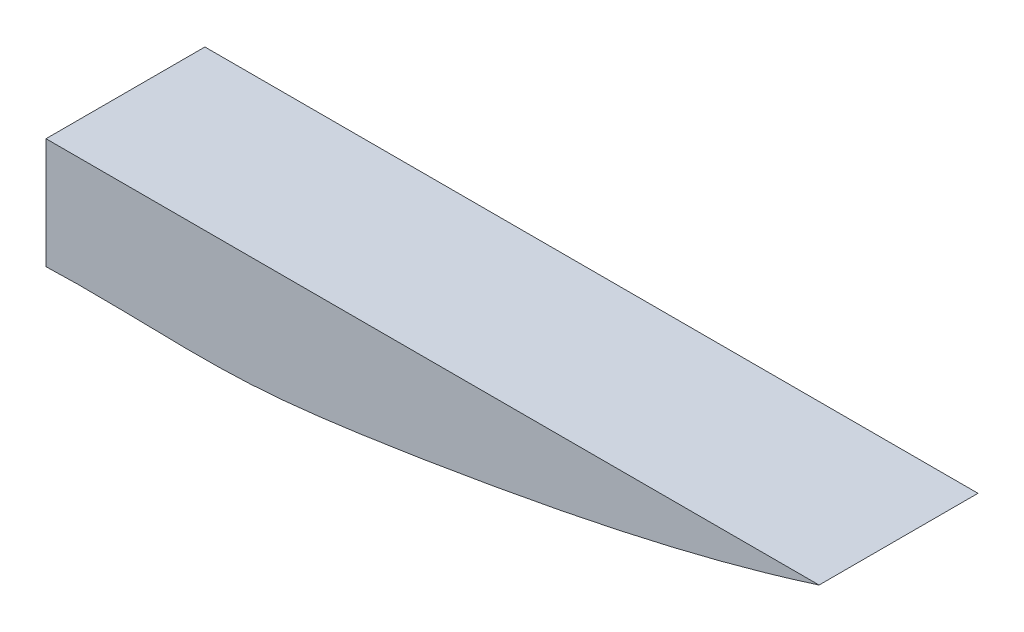
ISO-10303-21;
HEADER;
FILE_DESCRIPTION(('STEP AP214'),'2;1');
FILE_NAME('part.step','',(''),(''),'','','');
FILE_SCHEMA(('AUTOMOTIVE_DESIGN { 1 0 10303 214 1 1 1 1 }'));
ENDSEC;
DATA;
#1=APPLICATION_CONTEXT('core data for automotive mechanical design processes');
#2=APPLICATION_PROTOCOL_DEFINITION('international standard','automotive_design',2000,#1);
#3=PRODUCT_CONTEXT('',#1,'mechanical');
#4=PRODUCT('Part','Part','',(#3));
#5=PRODUCT_RELATED_PRODUCT_CATEGORY('part','',(#4));
#6=PRODUCT_DEFINITION_FORMATION('','',#4);
#7=PRODUCT_DEFINITION_CONTEXT('part definition',#1,'design');
#8=PRODUCT_DEFINITION('design','',#6,#7);
#9=PRODUCT_DEFINITION_SHAPE('','',#8);
#10=(LENGTH_UNIT() NAMED_UNIT(*) SI_UNIT(.MILLI.,.METRE.));
#11=(NAMED_UNIT(*) PLANE_ANGLE_UNIT() SI_UNIT($,.RADIAN.));
#12=(NAMED_UNIT(*) SI_UNIT($,.STERADIAN.) SOLID_ANGLE_UNIT());
#13=UNCERTAINTY_MEASURE_WITH_UNIT(LENGTH_MEASURE(1.E-05),#10,'distance_accuracy_value','');
#14=(GEOMETRIC_REPRESENTATION_CONTEXT(3) GLOBAL_UNCERTAINTY_ASSIGNED_CONTEXT((#13)) GLOBAL_UNIT_ASSIGNED_CONTEXT((#10,
#11,#12)) REPRESENTATION_CONTEXT('',''));
#15=CARTESIAN_POINT('',(0.,0.,0.));
#16=DIRECTION('',(0.,0.,1.));
#17=DIRECTION('',(1.,0.,0.));
#18=AXIS2_PLACEMENT_3D('',#15,#16,#17);
#19=CARTESIAN_POINT('',(0.,0.,-21.5));
#20=DIRECTION('',(0.,1.,0.));
#21=DIRECTION('',(0.,0.,1.));
#22=AXIS2_PLACEMENT_3D('',#19,#20,#21);
#23=PLANE('',#22);
#24=DIRECTION('',(-1.,0.,0.));
#25=VECTOR('',#24,1.);
#26=CARTESIAN_POINT('',(0.,0.,0.));
#27=LINE('',#26,#25);
#28=CARTESIAN_POINT('',(104.6,0.,0.));
#29=VERTEX_POINT('',#28);
#30=CARTESIAN_POINT('',(0.,0.,0.));
#31=VERTEX_POINT('',#30);
#32=EDGE_CURVE('E90',#29,#31,#27,.T.);
#33=ORIENTED_EDGE('',*,*,#32,.F.);
#34=DIRECTION('',(0.,0.,1.));
#35=VECTOR('',#34,1.);
#36=CARTESIAN_POINT('',(104.6,0.,-21.5));
#37=LINE('',#36,#35);
#38=CARTESIAN_POINT('',(104.6,0.,-21.5));
#39=VERTEX_POINT('',#38);
#40=EDGE_CURVE('E11',#39,#29,#37,.T.);
#41=ORIENTED_EDGE('',*,*,#40,.F.);
#42=DIRECTION('',(-1.,0.,0.));
#43=VECTOR('',#42,1.);
#44=CARTESIAN_POINT('',(0.,0.,-21.5));
#45=LINE('',#44,#43);
#46=CARTESIAN_POINT('',(0.,0.,-21.5));
#47=VERTEX_POINT('',#46);
#48=EDGE_CURVE('E79',#39,#47,#45,.T.);
#49=ORIENTED_EDGE('',*,*,#48,.T.);
#50=DIRECTION('',(0.,0.,1.));
#51=VECTOR('',#50,1.);
#52=CARTESIAN_POINT('',(0.,0.,-21.5));
#53=LINE('',#52,#51);
#54=EDGE_CURVE('E38',#47,#31,#53,.T.);
#55=ORIENTED_EDGE('',*,*,#54,.T.);
#56=EDGE_LOOP('',(#33,#41,#49,#55));
#57=FACE_BOUND('',#56,.T.);
#58=ADVANCED_FACE('F35',(#57),#23,.T.);
#59=CARTESIAN_POINT('',(0.,-15.,-21.5));
#60=CARTESIAN_POINT('',(8.72209860037072,-14.6533761054762,-21.5));
#61=CARTESIAN_POINT('',(23.1679338693288,-15.8337992283628,-21.5));
#62=CARTESIAN_POINT('',(42.3954806364705,-13.4598614785974,-21.5));
#63=CARTESIAN_POINT('',(68.6905575955601,-9.2077903351784,-21.5));
#64=CARTESIAN_POINT('',(89.2679365314157,-4.90292383187878,-21.5));
#65=CARTESIAN_POINT('',(104.6,0.,-21.5));
#66=B_SPLINE_CURVE_WITH_KNOTS('',3,(#59,#60,#61,#62,#63,#64,#65),.UNSPECIFIED.,.F.,.F.,(4,1,1,1,
4),(0.,0.246872266456216,0.406938063457193,0.546001010684599,1.),.UNSPECIFIED.);
#67=DIRECTION('',(0.,0.,1.));
#68=VECTOR('',#67,1.);
#69=SURFACE_OF_LINEAR_EXTRUSION('',#66,#68);
#70=CARTESIAN_POINT('',(0.,-15.,0.));
#71=CARTESIAN_POINT('',(8.72209860037072,-14.6533761054762,0.));
#72=CARTESIAN_POINT('',(23.1679338693288,-15.8337992283628,0.));
#73=CARTESIAN_POINT('',(42.3954806364705,-13.4598614785974,0.));
#74=CARTESIAN_POINT('',(68.6905575955601,-9.2077903351784,0.));
#75=CARTESIAN_POINT('',(89.2679365314157,-4.90292383187878,0.));
#76=CARTESIAN_POINT('',(104.6,0.,0.));
#77=B_SPLINE_CURVE_WITH_KNOTS('',3,(#70,#71,#72,#73,#74,#75,#76),.UNSPECIFIED.,.F.,.F.,(4,1,1,1,
4),(0.,0.246872266456216,0.406938063457193,0.546001010684599,1.),.UNSPECIFIED.);
#78=CARTESIAN_POINT('',(0.,-15.,0.));
#79=VERTEX_POINT('',#78);
#80=EDGE_CURVE('E81',#79,#29,#77,.T.);
#81=ORIENTED_EDGE('',*,*,#80,.F.);
#82=DIRECTION('',(0.,0.,1.));
#83=VECTOR('',#82,1.);
#84=CARTESIAN_POINT('',(0.,-15.,-21.5));
#85=LINE('',#84,#83);
#86=CARTESIAN_POINT('',(0.,-15.,-21.5));
#87=VERTEX_POINT('',#86);
#88=EDGE_CURVE('E44',#87,#79,#85,.T.);
#89=ORIENTED_EDGE('',*,*,#88,.F.);
#90=EDGE_CURVE('E76',#87,#39,#66,.T.);
#91=ORIENTED_EDGE('',*,*,#90,.T.);
#92=ORIENTED_EDGE('',*,*,#40,.T.);
#93=EDGE_LOOP('',(#81,#89,#91,#92));
#94=FACE_BOUND('',#93,.T.);
#95=ADVANCED_FACE('F96',(#94),#69,.T.);
#96=CARTESIAN_POINT('',(0.,0.,-21.5));
#97=DIRECTION('',(-1.,0.,0.));
#98=DIRECTION('',(0.,-1.,0.));
#99=AXIS2_PLACEMENT_3D('',#96,#97,#98);
#100=PLANE('',#99);
#101=DIRECTION('',(0.,-1.,0.));
#102=VECTOR('',#101,1.);
#103=CARTESIAN_POINT('',(0.,0.,0.));
#104=LINE('',#103,#102);
#105=EDGE_CURVE('E74',#31,#79,#104,.T.);
#106=ORIENTED_EDGE('',*,*,#105,.F.);
#107=ORIENTED_EDGE('',*,*,#54,.F.);
#108=DIRECTION('',(0.,-1.,0.));
#109=VECTOR('',#108,1.);
#110=CARTESIAN_POINT('',(0.,0.,-21.5));
#111=LINE('',#110,#109);
#112=EDGE_CURVE('E72',#47,#87,#111,.T.);
#113=ORIENTED_EDGE('',*,*,#112,.T.);
#114=ORIENTED_EDGE('',*,*,#88,.T.);
#115=EDGE_LOOP('',(#106,#107,#113,#114));
#116=FACE_BOUND('',#115,.T.);
#117=ADVANCED_FACE('F71',(#116),#100,.T.);
#118=CARTESIAN_POINT('',(52.8735863508143,-11.7462325671097,-21.5));
#119=DIRECTION('',(0.,0.,1.));
#120=DIRECTION('',(1.,0.,0.));
#121=AXIS2_PLACEMENT_3D('',#118,#119,#120);
#122=PLANE('',#121);
#123=ORIENTED_EDGE('',*,*,#48,.F.);
#124=ORIENTED_EDGE('',*,*,#90,.F.);
#125=ORIENTED_EDGE('',*,*,#112,.F.);
#126=EDGE_LOOP('',(#123,#124,#125));
#127=FACE_BOUND('',#126,.T.);
#128=ADVANCED_FACE('F78',(#127),#122,.F.);
#129=CARTESIAN_POINT('',(52.8735863508143,-11.7462325671097,0.));
#130=DIRECTION('',(0.,0.,1.));
#131=DIRECTION('',(1.,0.,0.));
#132=AXIS2_PLACEMENT_3D('',#129,#130,#131);
#133=PLANE('',#132);
#134=ORIENTED_EDGE('',*,*,#32,.T.);
#135=ORIENTED_EDGE('',*,*,#105,.T.);
#136=ORIENTED_EDGE('',*,*,#80,.T.);
#137=EDGE_LOOP('',(#134,#135,#136));
#138=FACE_BOUND('',#137,.T.);
#139=ADVANCED_FACE('F99',(#138),#133,.T.);
#140=CLOSED_SHELL('',(#58,#95,#117,#128,#139));
#141=MANIFOLD_SOLID_BREP('B2',#140);
#142=ADVANCED_BREP_SHAPE_REPRESENTATION('',(#18,#141),#14);
#143=SHAPE_DEFINITION_REPRESENTATION(#9,#142);
ENDSEC;
END-ISO-10303-21;
